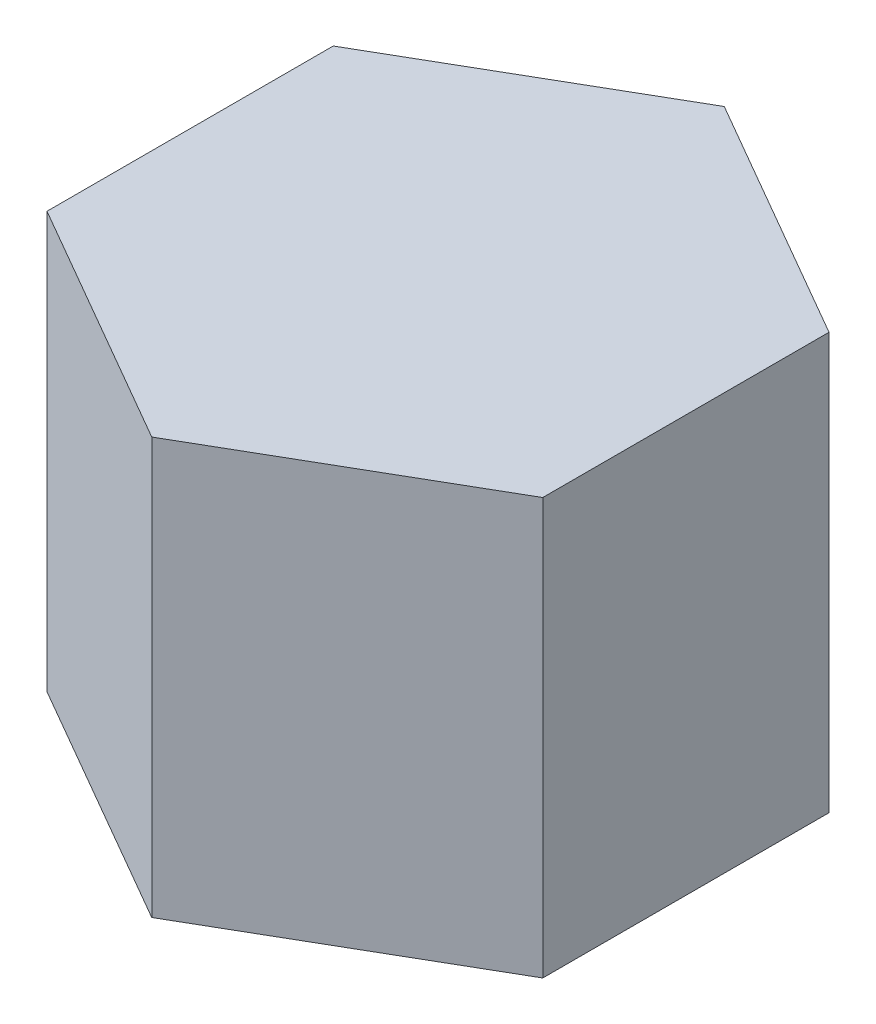
ISO-10303-21;
HEADER;
FILE_DESCRIPTION(('STEP AP214'),'2;1');
FILE_NAME('part.step','',(''),(''),'','','');
FILE_SCHEMA(('AUTOMOTIVE_DESIGN { 1 0 10303 214 1 1 1 1 }'));
ENDSEC;
DATA;
#1=APPLICATION_CONTEXT('core data for automotive mechanical design processes');
#2=APPLICATION_PROTOCOL_DEFINITION('international standard','automotive_design',2000,#1);
#3=PRODUCT_CONTEXT('',#1,'mechanical');
#4=PRODUCT('Part','Part','',(#3));
#5=PRODUCT_RELATED_PRODUCT_CATEGORY('part','',(#4));
#6=PRODUCT_DEFINITION_FORMATION('','',#4);
#7=PRODUCT_DEFINITION_CONTEXT('part definition',#1,'design');
#8=PRODUCT_DEFINITION('design','',#6,#7);
#9=PRODUCT_DEFINITION_SHAPE('','',#8);
#10=(LENGTH_UNIT() NAMED_UNIT(*) SI_UNIT(.MILLI.,.METRE.));
#11=(NAMED_UNIT(*) PLANE_ANGLE_UNIT() SI_UNIT($,.RADIAN.));
#12=(NAMED_UNIT(*) SI_UNIT($,.STERADIAN.) SOLID_ANGLE_UNIT());
#13=UNCERTAINTY_MEASURE_WITH_UNIT(LENGTH_MEASURE(1.E-05),#10,'distance_accuracy_value','');
#14=(GEOMETRIC_REPRESENTATION_CONTEXT(3) GLOBAL_UNCERTAINTY_ASSIGNED_CONTEXT((#13)) GLOBAL_UNIT_ASSIGNED_CONTEXT((#10,
#11,#12)) REPRESENTATION_CONTEXT('',''));
#15=CARTESIAN_POINT('',(0.,0.,0.));
#16=DIRECTION('',(0.,0.,1.));
#17=DIRECTION('',(1.,0.,0.));
#18=AXIS2_PLACEMENT_3D('',#15,#16,#17);
#19=CARTESIAN_POINT('',(203.839551417382,-147.556598747966,289.083895009141));
#20=DIRECTION('',(-0.499999999999943,0.,-0.866025403784471));
#21=DIRECTION('',(-0.866025403784471,0.,0.499999999999943));
#22=AXIS2_PLACEMENT_3D('',#19,#20,#21);
#23=PLANE('',#22);
#24=CARTESIAN_POINT('',(204.142660308706,-147.047793579175,288.908895009141));
#25=DIRECTION('',(-0.866025403784471,0.,0.499999999999943));
#26=VECTOR('',#25,1.);
#27=LINE('',#24,#26);
#28=CARTESIAN_POINT('',(204.142660308706,-147.047793579175,288.908895009141));
#29=VERTEX_POINT('',#28);
#30=CARTESIAN_POINT('',(203.839551417382,-147.047793579175,289.083895009141));
#31=VERTEX_POINT('',#30);
#32=EDGE_CURVE('E170',#29,#31,#27,.T.);
#33=ORIENTED_EDGE('',*,*,#32,.T.);
#34=CARTESIAN_POINT('',(203.839551417382,-147.556598747966,289.083895009141));
#35=DIRECTION('',(0.,1.,0.));
#36=VECTOR('',#35,1.);
#37=LINE('',#34,#36);
#38=CARTESIAN_POINT('',(203.839551417382,-147.556598747966,289.083895009141));
#39=VERTEX_POINT('',#38);
#40=EDGE_CURVE('E35',#39,#31,#37,.T.);
#41=ORIENTED_EDGE('',*,*,#40,.F.);
#42=CARTESIAN_POINT('',(204.142660308706,-147.556598747966,288.908895009141));
#43=DIRECTION('',(-0.866025403784471,0.,0.499999999999943));
#44=VECTOR('',#43,1.);
#45=LINE('',#42,#44);
#46=CARTESIAN_POINT('',(204.142660308706,-147.556598747966,288.908895009141));
#47=VERTEX_POINT('',#46);
#48=EDGE_CURVE('E159',#47,#39,#45,.T.);
#49=ORIENTED_EDGE('',*,*,#48,.F.);
#50=CARTESIAN_POINT('',(204.142660308706,-147.556598747966,288.908895009141));
#51=DIRECTION('',(0.,1.,0.));
#52=VECTOR('',#51,1.);
#53=LINE('',#50,#52);
#54=EDGE_CURVE('E10',#47,#29,#53,.T.);
#55=ORIENTED_EDGE('',*,*,#54,.T.);
#56=EDGE_LOOP('',(#33,#41,#49,#55));
#57=FACE_BOUND('',#56,.T.);
#58=ADVANCED_FACE('F16',(#57),#23,.F.);
#59=CARTESIAN_POINT('',(204.142660308706,-147.556598747966,291.594471220494));
#60=DIRECTION('',(-1.,0.,0.));
#61=DIRECTION('',(0.,-1.,0.));
#62=AXIS2_PLACEMENT_3D('',#59,#60,#61);
#63=PLANE('',#62);
#64=CARTESIAN_POINT('',(204.142660308706,-147.047793579175,288.558895009141));
#65=DIRECTION('',(0.,0.,1.));
#66=VECTOR('',#65,1.);
#67=LINE('',#64,#66);
#68=CARTESIAN_POINT('',(204.142660308706,-147.047793579175,288.558895009141));
#69=VERTEX_POINT('',#68);
#70=EDGE_CURVE('E167',#69,#29,#67,.T.);
#71=ORIENTED_EDGE('',*,*,#70,.T.);
#72=ORIENTED_EDGE('',*,*,#54,.F.);
#73=CARTESIAN_POINT('',(204.142660308706,-147.556598747966,288.558895009141));
#74=DIRECTION('',(0.,0.,1.));
#75=VECTOR('',#74,1.);
#76=LINE('',#73,#75);
#77=CARTESIAN_POINT('',(204.142660308706,-147.556598747966,288.558895009141));
#78=VERTEX_POINT('',#77);
#79=EDGE_CURVE('E156',#78,#47,#76,.T.);
#80=ORIENTED_EDGE('',*,*,#79,.F.);
#81=CARTESIAN_POINT('',(204.142660308706,-147.556598747966,288.558895009141));
#82=DIRECTION('',(0.,1.,0.));
#83=VECTOR('',#82,1.);
#84=LINE('',#81,#83);
#85=EDGE_CURVE('E27',#78,#69,#84,.T.);
#86=ORIENTED_EDGE('',*,*,#85,.T.);
#87=EDGE_LOOP('',(#71,#72,#80,#86));
#88=FACE_BOUND('',#87,.T.);
#89=ADVANCED_FACE('F189',(#88),#63,.F.);
#90=CARTESIAN_POINT('',(204.142660308706,-147.556598747966,288.558895009141));
#91=DIRECTION('',(-0.499999999999978,0.,0.866025403784452));
#92=DIRECTION('',(0.866025403784452,0.,0.499999999999978));
#93=AXIS2_PLACEMENT_3D('',#90,#91,#92);
#94=PLANE('',#93);
#95=CARTESIAN_POINT('',(203.839551417382,-147.047793579175,288.383895009141));
#96=DIRECTION('',(0.866025403784452,0.,0.499999999999978));
#97=VECTOR('',#96,1.);
#98=LINE('',#95,#97);
#99=CARTESIAN_POINT('',(203.839551417382,-147.047793579175,288.383895009141));
#100=VERTEX_POINT('',#99);
#101=EDGE_CURVE('E163',#100,#69,#98,.T.);
#102=ORIENTED_EDGE('',*,*,#101,.T.);
#103=ORIENTED_EDGE('',*,*,#85,.F.);
#104=CARTESIAN_POINT('',(203.839551417382,-147.556598747966,288.383895009141));
#105=DIRECTION('',(0.866025403784452,0.,0.499999999999978));
#106=VECTOR('',#105,1.);
#107=LINE('',#104,#106);
#108=CARTESIAN_POINT('',(203.839551417382,-147.556598747966,288.383895009141));
#109=VERTEX_POINT('',#108);
#110=EDGE_CURVE('E106',#109,#78,#107,.T.);
#111=ORIENTED_EDGE('',*,*,#110,.F.);
#112=CARTESIAN_POINT('',(203.839551417382,-147.556598747966,288.383895009141));
#113=DIRECTION('',(0.,1.,0.));
#114=VECTOR('',#113,1.);
#115=LINE('',#112,#114);
#116=EDGE_CURVE('E94',#109,#100,#115,.T.);
#117=ORIENTED_EDGE('',*,*,#116,.T.);
#118=EDGE_LOOP('',(#102,#103,#111,#117));
#119=FACE_BOUND('',#118,.T.);
#120=ADVANCED_FACE('F198',(#119),#94,.F.);
#121=CARTESIAN_POINT('',(203.839551417382,-147.556598747966,288.383895009141));
#122=DIRECTION('',(0.499999999999978,0.,0.866025403784452));
#123=DIRECTION('',(0.866025403784452,0.,-0.499999999999978));
#124=AXIS2_PLACEMENT_3D('',#121,#122,#123);
#125=PLANE('',#124);
#126=CARTESIAN_POINT('',(203.536442526057,-147.047793579175,288.558895009141));
#127=DIRECTION('',(0.866025403784452,0.,-0.499999999999978));
#128=VECTOR('',#127,1.);
#129=LINE('',#126,#128);
#130=CARTESIAN_POINT('',(203.536442526057,-147.047793579175,288.558895009141));
#131=VERTEX_POINT('',#130);
#132=EDGE_CURVE('E162',#131,#100,#129,.T.);
#133=ORIENTED_EDGE('',*,*,#132,.T.);
#134=ORIENTED_EDGE('',*,*,#116,.F.);
#135=CARTESIAN_POINT('',(203.536442526057,-147.556598747966,288.558895009141));
#136=DIRECTION('',(0.866025403784452,0.,-0.499999999999978));
#137=VECTOR('',#136,1.);
#138=LINE('',#135,#137);
#139=CARTESIAN_POINT('',(203.536442526057,-147.556598747966,288.558895009141));
#140=VERTEX_POINT('',#139);
#141=EDGE_CURVE('E98',#140,#109,#138,.T.);
#142=ORIENTED_EDGE('',*,*,#141,.F.);
#143=CARTESIAN_POINT('',(203.536442526057,-147.556598747966,288.558895009141));
#144=DIRECTION('',(0.,1.,0.));
#145=VECTOR('',#144,1.);
#146=LINE('',#143,#145);
#147=EDGE_CURVE('E79',#140,#131,#146,.T.);
#148=ORIENTED_EDGE('',*,*,#147,.T.);
#149=EDGE_LOOP('',(#133,#134,#142,#148));
#150=FACE_BOUND('',#149,.T.);
#151=ADVANCED_FACE('F100',(#150),#125,.F.);
#152=CARTESIAN_POINT('',(203.536442526057,-147.556598747966,291.594471220494));
#153=DIRECTION('',(1.,0.,0.));
#154=DIRECTION('',(0.,1.,0.));
#155=AXIS2_PLACEMENT_3D('',#152,#153,#154);
#156=PLANE('',#155);
#157=CARTESIAN_POINT('',(203.536442526057,-147.047793579175,288.908895009141));
#158=DIRECTION('',(0.,0.,-1.));
#159=VECTOR('',#158,1.);
#160=LINE('',#157,#159);
#161=CARTESIAN_POINT('',(203.536442526057,-147.047793579175,288.908895009141));
#162=VERTEX_POINT('',#161);
#163=EDGE_CURVE('E88',#162,#131,#160,.T.);
#164=ORIENTED_EDGE('',*,*,#163,.T.);
#165=ORIENTED_EDGE('',*,*,#147,.F.);
#166=CARTESIAN_POINT('',(203.536442526057,-147.556598747966,288.908895009141));
#167=DIRECTION('',(0.,0.,-1.));
#168=VECTOR('',#167,1.);
#169=LINE('',#166,#168);
#170=CARTESIAN_POINT('',(203.536442526057,-147.556598747966,288.908895009141));
#171=VERTEX_POINT('',#170);
#172=EDGE_CURVE('E84',#171,#140,#169,.T.);
#173=ORIENTED_EDGE('',*,*,#172,.F.);
#174=CARTESIAN_POINT('',(203.536442526057,-147.556598747966,288.908895009141));
#175=DIRECTION('',(0.,1.,0.));
#176=VECTOR('',#175,1.);
#177=LINE('',#174,#176);
#178=EDGE_CURVE('E58',#171,#162,#177,.T.);
#179=ORIENTED_EDGE('',*,*,#178,.T.);
#180=EDGE_LOOP('',(#164,#165,#173,#179));
#181=FACE_BOUND('',#180,.T.);
#182=ADVANCED_FACE('F82',(#181),#156,.F.);
#183=CARTESIAN_POINT('',(203.536442526057,-147.556598747966,288.908895009141));
#184=DIRECTION('',(0.499999999999943,0.,-0.866025403784471));
#185=DIRECTION('',(-0.866025403784471,0.,-0.499999999999943));
#186=AXIS2_PLACEMENT_3D('',#183,#184,#185);
#187=PLANE('',#186);
#188=CARTESIAN_POINT('',(203.839551417382,-147.047793579175,289.083895009141));
#189=DIRECTION('',(-0.866025403784471,0.,-0.499999999999943));
#190=VECTOR('',#189,1.);
#191=LINE('',#188,#190);
#192=EDGE_CURVE('E160',#31,#162,#191,.T.);
#193=ORIENTED_EDGE('',*,*,#192,.T.);
#194=ORIENTED_EDGE('',*,*,#178,.F.);
#195=CARTESIAN_POINT('',(203.839551417382,-147.556598747966,289.083895009141));
#196=DIRECTION('',(-0.866025403784471,0.,-0.499999999999943));
#197=VECTOR('',#196,1.);
#198=LINE('',#195,#197);
#199=EDGE_CURVE('E112',#39,#171,#198,.T.);
#200=ORIENTED_EDGE('',*,*,#199,.F.);
#201=ORIENTED_EDGE('',*,*,#40,.T.);
#202=EDGE_LOOP('',(#193,#194,#200,#201));
#203=FACE_BOUND('',#202,.T.);
#204=ADVANCED_FACE('F131',(#203),#187,.F.);
#205=CARTESIAN_POINT('',(206.491105863044,-147.556598747966,291.594471220494));
#206=DIRECTION('',(0.,1.,0.));
#207=DIRECTION('',(-1.,0.,0.));
#208=AXIS2_PLACEMENT_3D('',#205,#206,#207);
#209=PLANE('',#208);
#210=ORIENTED_EDGE('',*,*,#48,.T.);
#211=ORIENTED_EDGE('',*,*,#199,.T.);
#212=ORIENTED_EDGE('',*,*,#172,.T.);
#213=ORIENTED_EDGE('',*,*,#141,.T.);
#214=ORIENTED_EDGE('',*,*,#110,.T.);
#215=ORIENTED_EDGE('',*,*,#79,.T.);
#216=EDGE_LOOP('',(#210,#211,#212,#213,#214,#215));
#217=FACE_BOUND('',#216,.T.);
#218=ADVANCED_FACE('F111',(#217),#209,.F.);
#219=CARTESIAN_POINT('',(206.491105863044,-147.047793579175,291.594471220494));
#220=DIRECTION('',(0.,1.,0.));
#221=DIRECTION('',(-1.,0.,0.));
#222=AXIS2_PLACEMENT_3D('',#219,#220,#221);
#223=PLANE('',#222);
#224=ORIENTED_EDGE('',*,*,#32,.F.);
#225=ORIENTED_EDGE('',*,*,#70,.F.);
#226=ORIENTED_EDGE('',*,*,#101,.F.);
#227=ORIENTED_EDGE('',*,*,#132,.F.);
#228=ORIENTED_EDGE('',*,*,#163,.F.);
#229=ORIENTED_EDGE('',*,*,#192,.F.);
#230=EDGE_LOOP('',(#224,#225,#226,#227,#228,#229));
#231=FACE_BOUND('',#230,.T.);
#232=ADVANCED_FACE('F130',(#231),#223,.T.);
#233=CLOSED_SHELL('',(#58,#89,#120,#151,#182,#204,#218,#232));
#234=MANIFOLD_SOLID_BREP('B1',#233);
#235=ADVANCED_BREP_SHAPE_REPRESENTATION('',(#18,#234),#14);
#236=SHAPE_DEFINITION_REPRESENTATION(#9,#235);
ENDSEC;
END-ISO-10303-21;
